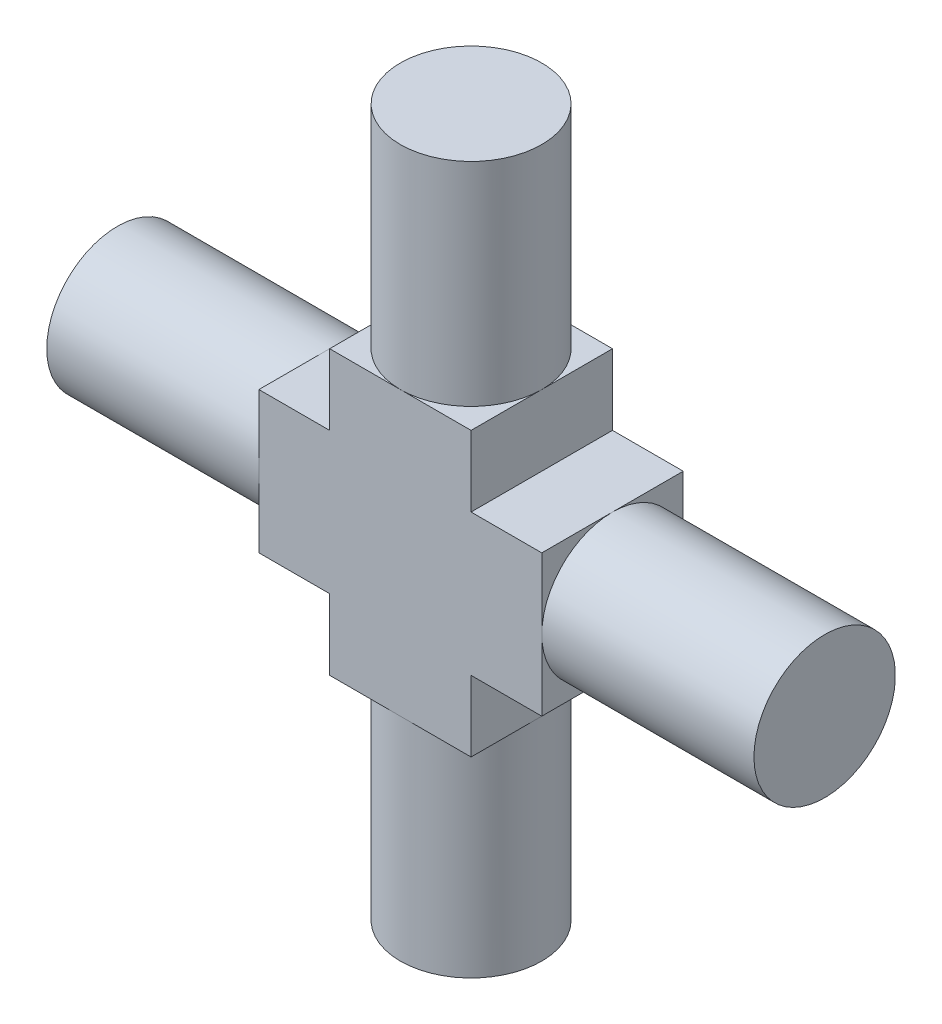
ISO-10303-21;
HEADER;
FILE_DESCRIPTION(('STEP AP214'),'2;1');
FILE_NAME('part.step','',(''),(''),'','','');
FILE_SCHEMA(('AUTOMOTIVE_DESIGN { 1 0 10303 214 1 1 1 1 }'));
ENDSEC;
DATA;
#1=APPLICATION_CONTEXT('core data for automotive mechanical design processes');
#2=APPLICATION_PROTOCOL_DEFINITION('international standard','automotive_design',2000,#1);
#3=PRODUCT_CONTEXT('',#1,'mechanical');
#4=PRODUCT('Part','Part','',(#3));
#5=PRODUCT_RELATED_PRODUCT_CATEGORY('part','',(#4));
#6=PRODUCT_DEFINITION_FORMATION('','',#4);
#7=PRODUCT_DEFINITION_CONTEXT('part definition',#1,'design');
#8=PRODUCT_DEFINITION('design','',#6,#7);
#9=PRODUCT_DEFINITION_SHAPE('','',#8);
#10=(LENGTH_UNIT() NAMED_UNIT(*) SI_UNIT(.MILLI.,.METRE.));
#11=(NAMED_UNIT(*) PLANE_ANGLE_UNIT() SI_UNIT($,.RADIAN.));
#12=(NAMED_UNIT(*) SI_UNIT($,.STERADIAN.) SOLID_ANGLE_UNIT());
#13=UNCERTAINTY_MEASURE_WITH_UNIT(LENGTH_MEASURE(1.E-05),#10,'distance_accuracy_value','');
#14=(GEOMETRIC_REPRESENTATION_CONTEXT(3) GLOBAL_UNCERTAINTY_ASSIGNED_CONTEXT((#13)) GLOBAL_UNIT_ASSIGNED_CONTEXT((#10,
#11,#12)) REPRESENTATION_CONTEXT('',''));
#15=CARTESIAN_POINT('',(0.,0.,0.));
#16=DIRECTION('',(0.,0.,1.));
#17=DIRECTION('',(1.,0.,0.));
#18=AXIS2_PLACEMENT_3D('',#15,#16,#17);
#19=CARTESIAN_POINT('',(-5.,2.5,5.));
#20=DIRECTION('',(1.,0.,0.));
#21=DIRECTION('',(0.,0.,-1.));
#22=AXIS2_PLACEMENT_3D('',#19,#20,#21);
#23=PLANE('',#22);
#24=CARTESIAN_POINT('',(-5.,0.,2.5));
#25=DIRECTION('',(-1.,0.,0.));
#26=DIRECTION('',(0.,0.,1.));
#27=AXIS2_PLACEMENT_3D('',#24,#25,#26);
#28=CIRCLE('',#27,2.5);
#29=CARTESIAN_POINT('',(-5.,0.,5.));
#30=VERTEX_POINT('',#29);
#31=CARTESIAN_POINT('',(-5.00000000000001,2.5,2.5));
#32=VERTEX_POINT('',#31);
#33=EDGE_CURVE('E57',#30,#32,#28,.T.);
#34=ORIENTED_EDGE('',*,*,#33,.F.);
#35=DIRECTION('',(0.,-1.,0.));
#36=VECTOR('',#35,1.);
#37=CARTESIAN_POINT('',(-5.,2.5,5.));
#38=LINE('',#37,#36);
#39=CARTESIAN_POINT('',(-5.,2.5,5.));
#40=VERTEX_POINT('',#39);
#41=EDGE_CURVE('E251',#40,#30,#38,.T.);
#42=ORIENTED_EDGE('',*,*,#41,.F.);
#43=DIRECTION('',(0.,0.,-1.));
#44=VECTOR('',#43,1.);
#45=CARTESIAN_POINT('',(-5.,2.5,5.));
#46=LINE('',#45,#44);
#47=EDGE_CURVE('E367',#40,#32,#46,.T.);
#48=ORIENTED_EDGE('',*,*,#47,.T.);
#49=EDGE_LOOP('',(#34,#42,#48));
#50=FACE_BOUND('',#49,.T.);
#51=ADVANCED_FACE('F45',(#50),#23,.F.);
#52=CARTESIAN_POINT('',(-5.,0.,0.));
#53=VERTEX_POINT('',#52);
#54=EDGE_CURVE('E11',#32,#53,#28,.T.);
#55=ORIENTED_EDGE('',*,*,#54,.F.);
#56=CARTESIAN_POINT('',(-5.,2.5,0.));
#57=VERTEX_POINT('',#56);
#58=EDGE_CURVE('E366',#32,#57,#46,.T.);
#59=ORIENTED_EDGE('',*,*,#58,.T.);
#60=DIRECTION('',(0.,-1.,0.));
#61=VECTOR('',#60,1.);
#62=CARTESIAN_POINT('',(-5.,2.5,0.));
#63=LINE('',#62,#61);
#64=EDGE_CURVE('E287',#57,#53,#63,.T.);
#65=ORIENTED_EDGE('',*,*,#64,.T.);
#66=EDGE_LOOP('',(#55,#59,#65));
#67=FACE_BOUND('',#66,.T.);
#68=ADVANCED_FACE('F378',(#67),#23,.F.);
#69=CARTESIAN_POINT('',(-4.99999999999999,-2.5,2.5));
#70=VERTEX_POINT('',#69);
#71=EDGE_CURVE('E55',#53,#70,#28,.T.);
#72=ORIENTED_EDGE('',*,*,#71,.F.);
#73=CARTESIAN_POINT('',(-5.,-2.5,0.));
#74=VERTEX_POINT('',#73);
#75=EDGE_CURVE('E286',#53,#74,#63,.T.);
#76=ORIENTED_EDGE('',*,*,#75,.T.);
#77=DIRECTION('',(0.,0.,-1.));
#78=VECTOR('',#77,1.);
#79=CARTESIAN_POINT('',(-5.,-2.5,5.));
#80=LINE('',#79,#78);
#81=EDGE_CURVE('E362',#70,#74,#80,.T.);
#82=ORIENTED_EDGE('',*,*,#81,.F.);
#83=EDGE_LOOP('',(#72,#76,#82));
#84=FACE_BOUND('',#83,.T.);
#85=ADVANCED_FACE('F430',(#84),#23,.F.);
#86=CARTESIAN_POINT('',(-2.5,-5.,5.));
#87=DIRECTION('',(0.,1.,0.));
#88=DIRECTION('',(-1.,0.,0.));
#89=AXIS2_PLACEMENT_3D('',#86,#87,#88);
#90=PLANE('',#89);
#91=CARTESIAN_POINT('',(0.,-5.,2.5));
#92=DIRECTION('',(0.,-1.,0.));
#93=DIRECTION('',(0.,0.,1.));
#94=AXIS2_PLACEMENT_3D('',#91,#92,#93);
#95=CIRCLE('',#94,2.5);
#96=CARTESIAN_POINT('',(0.,-5.,5.));
#97=VERTEX_POINT('',#96);
#98=CARTESIAN_POINT('',(-2.5,-5.,2.5));
#99=VERTEX_POINT('',#98);
#100=EDGE_CURVE('E400',#97,#99,#95,.T.);
#101=ORIENTED_EDGE('',*,*,#100,.F.);
#102=DIRECTION('',(1.,0.,0.));
#103=VECTOR('',#102,1.);
#104=CARTESIAN_POINT('',(-2.5,-5.,5.));
#105=LINE('',#104,#103);
#106=CARTESIAN_POINT('',(-2.5,-5.,5.));
#107=VERTEX_POINT('',#106);
#108=EDGE_CURVE('E261',#107,#97,#105,.T.);
#109=ORIENTED_EDGE('',*,*,#108,.F.);
#110=DIRECTION('',(0.,0.,-1.));
#111=VECTOR('',#110,1.);
#112=CARTESIAN_POINT('',(-2.5,-5.,5.));
#113=LINE('',#112,#111);
#114=EDGE_CURVE('E354',#107,#99,#113,.T.);
#115=ORIENTED_EDGE('',*,*,#114,.T.);
#116=EDGE_LOOP('',(#101,#109,#115));
#117=FACE_BOUND('',#116,.T.);
#118=ADVANCED_FACE('F441',(#117),#90,.F.);
#119=CARTESIAN_POINT('',(0.,-5.,0.));
#120=VERTEX_POINT('',#119);
#121=EDGE_CURVE('E404',#99,#120,#95,.T.);
#122=ORIENTED_EDGE('',*,*,#121,.F.);
#123=CARTESIAN_POINT('',(-2.5,-5.,0.));
#124=VERTEX_POINT('',#123);
#125=EDGE_CURVE('E353',#99,#124,#113,.T.);
#126=ORIENTED_EDGE('',*,*,#125,.T.);
#127=DIRECTION('',(1.,0.,0.));
#128=VECTOR('',#127,1.);
#129=CARTESIAN_POINT('',(-2.5,-5.,0.));
#130=LINE('',#129,#128);
#131=EDGE_CURVE('E298',#124,#120,#130,.T.);
#132=ORIENTED_EDGE('',*,*,#131,.T.);
#133=EDGE_LOOP('',(#122,#126,#132));
#134=FACE_BOUND('',#133,.T.);
#135=ADVANCED_FACE('F445',(#134),#90,.F.);
#136=CARTESIAN_POINT('',(2.5,-5.,2.5));
#137=VERTEX_POINT('',#136);
#138=EDGE_CURVE('E455',#120,#137,#95,.T.);
#139=ORIENTED_EDGE('',*,*,#138,.F.);
#140=CARTESIAN_POINT('',(2.5,-5.,0.));
#141=VERTEX_POINT('',#140);
#142=EDGE_CURVE('E297',#120,#141,#130,.T.);
#143=ORIENTED_EDGE('',*,*,#142,.T.);
#144=DIRECTION('',(0.,0.,-1.));
#145=VECTOR('',#144,1.);
#146=CARTESIAN_POINT('',(2.5,-5.,5.));
#147=LINE('',#146,#145);
#148=EDGE_CURVE('E348',#137,#141,#147,.T.);
#149=ORIENTED_EDGE('',*,*,#148,.F.);
#150=EDGE_LOOP('',(#139,#143,#149));
#151=FACE_BOUND('',#150,.T.);
#152=ADVANCED_FACE('F486',(#151),#90,.F.);
#153=CARTESIAN_POINT('',(5.,-2.5,5.));
#154=DIRECTION('',(-1.,0.,0.));
#155=DIRECTION('',(0.,-1.,0.));
#156=AXIS2_PLACEMENT_3D('',#153,#154,#155);
#157=PLANE('',#156);
#158=CARTESIAN_POINT('',(5.,0.,2.5));
#159=DIRECTION('',(1.,0.,0.));
#160=DIRECTION('',(0.,0.,1.));
#161=AXIS2_PLACEMENT_3D('',#158,#159,#160);
#162=CIRCLE('',#161,2.5);
#163=CARTESIAN_POINT('',(5.,0.,5.));
#164=VERTEX_POINT('',#163);
#165=CARTESIAN_POINT('',(5.00000000000003,-2.5,2.5));
#166=VERTEX_POINT('',#165);
#167=EDGE_CURVE('E211',#164,#166,#162,.T.);
#168=ORIENTED_EDGE('',*,*,#167,.F.);
#169=DIRECTION('',(0.,1.,0.));
#170=VECTOR('',#169,1.);
#171=CARTESIAN_POINT('',(5.,-2.5,5.));
#172=LINE('',#171,#170);
#173=CARTESIAN_POINT('',(5.,-2.5,5.));
#174=VERTEX_POINT('',#173);
#175=EDGE_CURVE('E186',#174,#164,#172,.T.);
#176=ORIENTED_EDGE('',*,*,#175,.F.);
#177=DIRECTION('',(0.,0.,-1.));
#178=VECTOR('',#177,1.);
#179=CARTESIAN_POINT('',(5.,-2.5,5.));
#180=LINE('',#179,#178);
#181=EDGE_CURVE('E213',#174,#166,#180,.T.);
#182=ORIENTED_EDGE('',*,*,#181,.T.);
#183=EDGE_LOOP('',(#168,#176,#182));
#184=FACE_BOUND('',#183,.T.);
#185=ADVANCED_FACE('F212',(#184),#157,.F.);
#186=CARTESIAN_POINT('',(5.,0.,0.));
#187=VERTEX_POINT('',#186);
#188=EDGE_CURVE('E219',#166,#187,#162,.T.);
#189=ORIENTED_EDGE('',*,*,#188,.F.);
#190=CARTESIAN_POINT('',(5.,-2.5,0.));
#191=VERTEX_POINT('',#190);
#192=EDGE_CURVE('E341',#166,#191,#180,.T.);
#193=ORIENTED_EDGE('',*,*,#192,.T.);
#194=DIRECTION('',(0.,1.,0.));
#195=VECTOR('',#194,1.);
#196=CARTESIAN_POINT('',(5.,-2.5,0.));
#197=LINE('',#196,#195);
#198=EDGE_CURVE('E310',#191,#187,#197,.T.);
#199=ORIENTED_EDGE('',*,*,#198,.T.);
#200=EDGE_LOOP('',(#189,#193,#199));
#201=FACE_BOUND('',#200,.T.);
#202=ADVANCED_FACE('F464',(#201),#157,.F.);
#203=CARTESIAN_POINT('',(4.99999999999998,2.5,2.5));
#204=VERTEX_POINT('',#203);
#205=EDGE_CURVE('E222',#187,#204,#162,.T.);
#206=ORIENTED_EDGE('',*,*,#205,.F.);
#207=CARTESIAN_POINT('',(5.,2.5,0.));
#208=VERTEX_POINT('',#207);
#209=EDGE_CURVE('E309',#187,#208,#197,.T.);
#210=ORIENTED_EDGE('',*,*,#209,.T.);
#211=DIRECTION('',(0.,0.,-1.));
#212=VECTOR('',#211,1.);
#213=CARTESIAN_POINT('',(5.,2.5,5.));
#214=LINE('',#213,#212);
#215=EDGE_CURVE('E338',#204,#208,#214,.T.);
#216=ORIENTED_EDGE('',*,*,#215,.F.);
#217=EDGE_LOOP('',(#206,#210,#216));
#218=FACE_BOUND('',#217,.T.);
#219=ADVANCED_FACE('F566',(#218),#157,.F.);
#220=CARTESIAN_POINT('',(2.5,5.,5.));
#221=DIRECTION('',(0.,-1.,0.));
#222=DIRECTION('',(0.,0.,-1.));
#223=AXIS2_PLACEMENT_3D('',#220,#221,#222);
#224=PLANE('',#223);
#225=CARTESIAN_POINT('',(0.,5.,2.5));
#226=DIRECTION('',(0.,1.,0.));
#227=DIRECTION('',(0.,0.,1.));
#228=AXIS2_PLACEMENT_3D('',#225,#226,#227);
#229=CIRCLE('',#228,2.5);
#230=CARTESIAN_POINT('',(0.,5.,5.));
#231=VERTEX_POINT('',#230);
#232=CARTESIAN_POINT('',(2.5,5.,2.5));
#233=VERTEX_POINT('',#232);
#234=EDGE_CURVE('E230',#231,#233,#229,.T.);
#235=ORIENTED_EDGE('',*,*,#234,.F.);
#236=DIRECTION('',(-1.,0.,0.));
#237=VECTOR('',#236,1.);
#238=CARTESIAN_POINT('',(2.5,5.,5.));
#239=LINE('',#238,#237);
#240=CARTESIAN_POINT('',(2.5,5.,5.));
#241=VERTEX_POINT('',#240);
#242=EDGE_CURVE('E275',#241,#231,#239,.T.);
#243=ORIENTED_EDGE('',*,*,#242,.F.);
#244=DIRECTION('',(0.,0.,-1.));
#245=VECTOR('',#244,1.);
#246=CARTESIAN_POINT('',(2.5,5.,5.));
#247=LINE('',#246,#245);
#248=EDGE_CURVE('E330',#241,#233,#247,.T.);
#249=ORIENTED_EDGE('',*,*,#248,.T.);
#250=EDGE_LOOP('',(#235,#243,#249));
#251=FACE_BOUND('',#250,.T.);
#252=ADVANCED_FACE('F611',(#251),#224,.F.);
#253=CARTESIAN_POINT('',(0.,5.,0.));
#254=VERTEX_POINT('',#253);
#255=EDGE_CURVE('E224',#233,#254,#229,.T.);
#256=ORIENTED_EDGE('',*,*,#255,.F.);
#257=CARTESIAN_POINT('',(2.5,5.,0.));
#258=VERTEX_POINT('',#257);
#259=EDGE_CURVE('E329',#233,#258,#247,.T.);
#260=ORIENTED_EDGE('',*,*,#259,.T.);
#261=DIRECTION('',(-1.,0.,0.));
#262=VECTOR('',#261,1.);
#263=CARTESIAN_POINT('',(2.5,5.,0.));
#264=LINE('',#263,#262);
#265=EDGE_CURVE('E247',#258,#254,#264,.T.);
#266=ORIENTED_EDGE('',*,*,#265,.T.);
#267=EDGE_LOOP('',(#256,#260,#266));
#268=FACE_BOUND('',#267,.T.);
#269=ADVANCED_FACE('F602',(#268),#224,.F.);
#270=CARTESIAN_POINT('',(-2.5,5.,2.5));
#271=VERTEX_POINT('',#270);
#272=EDGE_CURVE('E228',#254,#271,#229,.T.);
#273=ORIENTED_EDGE('',*,*,#272,.F.);
#274=CARTESIAN_POINT('',(-2.5,5.,0.));
#275=VERTEX_POINT('',#274);
#276=EDGE_CURVE('E321',#254,#275,#264,.T.);
#277=ORIENTED_EDGE('',*,*,#276,.T.);
#278=DIRECTION('',(0.,0.,-1.));
#279=VECTOR('',#278,1.);
#280=CARTESIAN_POINT('',(-2.5,5.,5.));
#281=LINE('',#280,#279);
#282=EDGE_CURVE('E278',#271,#275,#281,.T.);
#283=ORIENTED_EDGE('',*,*,#282,.F.);
#284=EDGE_LOOP('',(#273,#277,#283));
#285=FACE_BOUND('',#284,.T.);
#286=ADVANCED_FACE('F597',(#285),#224,.F.);
#287=CARTESIAN_POINT('',(-2.5,5.,5.));
#288=DIRECTION('',(1.,0.,0.));
#289=DIRECTION('',(0.,1.,0.));
#290=AXIS2_PLACEMENT_3D('',#287,#288,#289);
#291=PLANE('',#290);
#292=DIRECTION('',(0.,-1.,0.));
#293=VECTOR('',#292,1.);
#294=CARTESIAN_POINT('',(-2.5,5.,0.));
#295=LINE('',#294,#293);
#296=CARTESIAN_POINT('',(-2.5,2.5,0.));
#297=VERTEX_POINT('',#296);
#298=EDGE_CURVE('E237',#275,#297,#295,.T.);
#299=ORIENTED_EDGE('',*,*,#298,.T.);
#300=DIRECTION('',(0.,0.,-1.));
#301=VECTOR('',#300,1.);
#302=CARTESIAN_POINT('',(-2.5,2.5,5.));
#303=LINE('',#302,#301);
#304=CARTESIAN_POINT('',(-2.5,2.5,5.));
#305=VERTEX_POINT('',#304);
#306=EDGE_CURVE('E49',#305,#297,#303,.T.);
#307=ORIENTED_EDGE('',*,*,#306,.F.);
#308=DIRECTION('',(0.,-1.,0.));
#309=VECTOR('',#308,1.);
#310=CARTESIAN_POINT('',(-2.5,5.,5.));
#311=LINE('',#310,#309);
#312=CARTESIAN_POINT('',(-2.5,5.,5.));
#313=VERTEX_POINT('',#312);
#314=EDGE_CURVE('E243',#313,#305,#311,.T.);
#315=ORIENTED_EDGE('',*,*,#314,.F.);
#316=EDGE_CURVE('E325',#313,#271,#281,.T.);
#317=ORIENTED_EDGE('',*,*,#316,.T.);
#318=ORIENTED_EDGE('',*,*,#282,.T.);
#319=EDGE_LOOP('',(#299,#307,#315,#317,#318));
#320=FACE_BOUND('',#319,.T.);
#321=ADVANCED_FACE('F47',(#320),#291,.F.);
#322=CARTESIAN_POINT('',(-2.5,2.5,5.));
#323=DIRECTION('',(0.,-1.,0.));
#324=DIRECTION('',(1.,0.,0.));
#325=AXIS2_PLACEMENT_3D('',#322,#323,#324);
#326=PLANE('',#325);
#327=DIRECTION('',(-1.,0.,0.));
#328=VECTOR('',#327,1.);
#329=CARTESIAN_POINT('',(-2.5,2.5,0.));
#330=LINE('',#329,#328);
#331=EDGE_CURVE('E282',#297,#57,#330,.T.);
#332=ORIENTED_EDGE('',*,*,#331,.T.);
#333=ORIENTED_EDGE('',*,*,#58,.F.);
#334=ORIENTED_EDGE('',*,*,#47,.F.);
#335=DIRECTION('',(-1.,0.,0.));
#336=VECTOR('',#335,1.);
#337=CARTESIAN_POINT('',(-2.5,2.5,5.));
#338=LINE('',#337,#336);
#339=EDGE_CURVE('E246',#305,#40,#338,.T.);
#340=ORIENTED_EDGE('',*,*,#339,.F.);
#341=ORIENTED_EDGE('',*,*,#306,.T.);
#342=EDGE_LOOP('',(#332,#333,#334,#340,#341));
#343=FACE_BOUND('',#342,.T.);
#344=ADVANCED_FACE('F381',(#343),#326,.F.);
#345=EDGE_CURVE('E70',#70,#30,#28,.T.);
#346=ORIENTED_EDGE('',*,*,#345,.F.);
#347=CARTESIAN_POINT('',(-5.,-2.5,5.));
#348=VERTEX_POINT('',#347);
#349=EDGE_CURVE('E363',#348,#70,#80,.T.);
#350=ORIENTED_EDGE('',*,*,#349,.F.);
#351=EDGE_CURVE('E250',#30,#348,#38,.T.);
#352=ORIENTED_EDGE('',*,*,#351,.F.);
#353=EDGE_LOOP('',(#346,#350,#352));
#354=FACE_BOUND('',#353,.T.);
#355=ADVANCED_FACE('F426',(#354),#23,.F.);
#356=CARTESIAN_POINT('',(-5.,-2.5,5.));
#357=DIRECTION('',(0.,1.,0.));
#358=DIRECTION('',(-1.,0.,0.));
#359=AXIS2_PLACEMENT_3D('',#356,#357,#358);
#360=PLANE('',#359);
#361=DIRECTION('',(1.,0.,0.));
#362=VECTOR('',#361,1.);
#363=CARTESIAN_POINT('',(-5.,-2.5,0.));
#364=LINE('',#363,#362);
#365=CARTESIAN_POINT('',(-2.5,-2.5,0.));
#366=VERTEX_POINT('',#365);
#367=EDGE_CURVE('E290',#74,#366,#364,.T.);
#368=ORIENTED_EDGE('',*,*,#367,.T.);
#369=DIRECTION('',(0.,0.,-1.));
#370=VECTOR('',#369,1.);
#371=CARTESIAN_POINT('',(-2.5,-2.5,5.));
#372=LINE('',#371,#370);
#373=CARTESIAN_POINT('',(-2.5,-2.5,5.));
#374=VERTEX_POINT('',#373);
#375=EDGE_CURVE('E358',#374,#366,#372,.T.);
#376=ORIENTED_EDGE('',*,*,#375,.F.);
#377=DIRECTION('',(1.,0.,0.));
#378=VECTOR('',#377,1.);
#379=CARTESIAN_POINT('',(-5.,-2.5,5.));
#380=LINE('',#379,#378);
#381=EDGE_CURVE('E254',#348,#374,#380,.T.);
#382=ORIENTED_EDGE('',*,*,#381,.F.);
#383=ORIENTED_EDGE('',*,*,#349,.T.);
#384=ORIENTED_EDGE('',*,*,#81,.T.);
#385=EDGE_LOOP('',(#368,#376,#382,#383,#384));
#386=FACE_BOUND('',#385,.T.);
#387=ADVANCED_FACE('F433',(#386),#360,.F.);
#388=CARTESIAN_POINT('',(-2.5,-2.5,5.));
#389=DIRECTION('',(1.,0.,0.));
#390=DIRECTION('',(0.,1.,0.));
#391=AXIS2_PLACEMENT_3D('',#388,#389,#390);
#392=PLANE('',#391);
#393=DIRECTION('',(0.,-1.,0.));
#394=VECTOR('',#393,1.);
#395=CARTESIAN_POINT('',(-2.5,-2.5,0.));
#396=LINE('',#395,#394);
#397=EDGE_CURVE('E293',#366,#124,#396,.T.);
#398=ORIENTED_EDGE('',*,*,#397,.T.);
#399=ORIENTED_EDGE('',*,*,#125,.F.);
#400=ORIENTED_EDGE('',*,*,#114,.F.);
#401=DIRECTION('',(0.,-1.,0.));
#402=VECTOR('',#401,1.);
#403=CARTESIAN_POINT('',(-2.5,-2.5,5.));
#404=LINE('',#403,#402);
#405=EDGE_CURVE('E257',#374,#107,#404,.T.);
#406=ORIENTED_EDGE('',*,*,#405,.F.);
#407=ORIENTED_EDGE('',*,*,#375,.T.);
#408=EDGE_LOOP('',(#398,#399,#400,#406,#407));
#409=FACE_BOUND('',#408,.T.);
#410=ADVANCED_FACE('F438',(#409),#392,.F.);
#411=EDGE_CURVE('E405',#137,#97,#95,.T.);
#412=ORIENTED_EDGE('',*,*,#411,.F.);
#413=CARTESIAN_POINT('',(2.5,-5.,5.));
#414=VERTEX_POINT('',#413);
#415=EDGE_CURVE('E349',#414,#137,#147,.T.);
#416=ORIENTED_EDGE('',*,*,#415,.F.);
#417=EDGE_CURVE('E260',#97,#414,#105,.T.);
#418=ORIENTED_EDGE('',*,*,#417,.F.);
#419=EDGE_LOOP('',(#412,#416,#418));
#420=FACE_BOUND('',#419,.T.);
#421=ADVANCED_FACE('F448',(#420),#90,.F.);
#422=CARTESIAN_POINT('',(2.5,-5.,5.));
#423=DIRECTION('',(-1.,0.,0.));
#424=DIRECTION('',(0.,0.,1.));
#425=AXIS2_PLACEMENT_3D('',#422,#423,#424);
#426=PLANE('',#425);
#427=DIRECTION('',(0.,1.,0.));
#428=VECTOR('',#427,1.);
#429=CARTESIAN_POINT('',(2.5,-5.,0.));
#430=LINE('',#429,#428);
#431=CARTESIAN_POINT('',(2.5,-2.5,0.));
#432=VERTEX_POINT('',#431);
#433=EDGE_CURVE('E302',#141,#432,#430,.T.);
#434=ORIENTED_EDGE('',*,*,#433,.T.);
#435=DIRECTION('',(0.,0.,-1.));
#436=VECTOR('',#435,1.);
#437=CARTESIAN_POINT('',(2.5,-2.5,5.));
#438=LINE('',#437,#436);
#439=CARTESIAN_POINT('',(2.5,-2.5,5.));
#440=VERTEX_POINT('',#439);
#441=EDGE_CURVE('E344',#440,#432,#438,.T.);
#442=ORIENTED_EDGE('',*,*,#441,.F.);
#443=DIRECTION('',(0.,1.,0.));
#444=VECTOR('',#443,1.);
#445=CARTESIAN_POINT('',(2.5,-5.,5.));
#446=LINE('',#445,#444);
#447=EDGE_CURVE('E264',#414,#440,#446,.T.);
#448=ORIENTED_EDGE('',*,*,#447,.F.);
#449=ORIENTED_EDGE('',*,*,#415,.T.);
#450=ORIENTED_EDGE('',*,*,#148,.T.);
#451=EDGE_LOOP('',(#434,#442,#448,#449,#450));
#452=FACE_BOUND('',#451,.T.);
#453=ADVANCED_FACE('F490',(#452),#426,.F.);
#454=CARTESIAN_POINT('',(2.5,-2.5,5.));
#455=DIRECTION('',(0.,1.,0.));
#456=DIRECTION('',(-1.,0.,0.));
#457=AXIS2_PLACEMENT_3D('',#454,#455,#456);
#458=PLANE('',#457);
#459=DIRECTION('',(1.,0.,0.));
#460=VECTOR('',#459,1.);
#461=CARTESIAN_POINT('',(2.5,-2.5,0.));
#462=LINE('',#461,#460);
#463=EDGE_CURVE('E305',#432,#191,#462,.T.);
#464=ORIENTED_EDGE('',*,*,#463,.T.);
#465=ORIENTED_EDGE('',*,*,#192,.F.);
#466=ORIENTED_EDGE('',*,*,#181,.F.);
#467=DIRECTION('',(1.,0.,0.));
#468=VECTOR('',#467,1.);
#469=CARTESIAN_POINT('',(2.5,-2.5,5.));
#470=LINE('',#469,#468);
#471=EDGE_CURVE('E193',#440,#174,#470,.T.);
#472=ORIENTED_EDGE('',*,*,#471,.F.);
#473=ORIENTED_EDGE('',*,*,#441,.T.);
#474=EDGE_LOOP('',(#464,#465,#466,#472,#473));
#475=FACE_BOUND('',#474,.T.);
#476=ADVANCED_FACE('F467',(#475),#458,.F.);
#477=EDGE_CURVE('E204',#204,#164,#162,.T.);
#478=ORIENTED_EDGE('',*,*,#477,.F.);
#479=CARTESIAN_POINT('',(5.,2.5,5.));
#480=VERTEX_POINT('',#479);
#481=EDGE_CURVE('E207',#480,#204,#214,.T.);
#482=ORIENTED_EDGE('',*,*,#481,.F.);
#483=EDGE_CURVE('E190',#164,#480,#172,.T.);
#484=ORIENTED_EDGE('',*,*,#483,.F.);
#485=EDGE_LOOP('',(#478,#482,#484));
#486=FACE_BOUND('',#485,.T.);
#487=ADVANCED_FACE('F202',(#486),#157,.F.);
#488=CARTESIAN_POINT('',(5.,2.5,5.));
#489=DIRECTION('',(0.,-1.,0.));
#490=DIRECTION('',(1.,0.,0.));
#491=AXIS2_PLACEMENT_3D('',#488,#489,#490);
#492=PLANE('',#491);
#493=DIRECTION('',(-1.,0.,0.));
#494=VECTOR('',#493,1.);
#495=CARTESIAN_POINT('',(5.,2.5,0.));
#496=LINE('',#495,#494);
#497=CARTESIAN_POINT('',(2.5,2.5,0.));
#498=VERTEX_POINT('',#497);
#499=EDGE_CURVE('E314',#208,#498,#496,.T.);
#500=ORIENTED_EDGE('',*,*,#499,.T.);
#501=DIRECTION('',(0.,0.,-1.));
#502=VECTOR('',#501,1.);
#503=CARTESIAN_POINT('',(2.5,2.5,5.));
#504=LINE('',#503,#502);
#505=CARTESIAN_POINT('',(2.5,2.5,5.));
#506=VERTEX_POINT('',#505);
#507=EDGE_CURVE('E334',#506,#498,#504,.T.);
#508=ORIENTED_EDGE('',*,*,#507,.F.);
#509=DIRECTION('',(-1.,0.,0.));
#510=VECTOR('',#509,1.);
#511=CARTESIAN_POINT('',(5.,2.5,5.));
#512=LINE('',#511,#510);
#513=EDGE_CURVE('E199',#480,#506,#512,.T.);
#514=ORIENTED_EDGE('',*,*,#513,.F.);
#515=ORIENTED_EDGE('',*,*,#481,.T.);
#516=ORIENTED_EDGE('',*,*,#215,.T.);
#517=EDGE_LOOP('',(#500,#508,#514,#515,#516));
#518=FACE_BOUND('',#517,.T.);
#519=ADVANCED_FACE('F564',(#518),#492,.F.);
#520=CARTESIAN_POINT('',(2.5,2.5,5.));
#521=DIRECTION('',(-1.,0.,0.));
#522=DIRECTION('',(0.,-1.,0.));
#523=AXIS2_PLACEMENT_3D('',#520,#521,#522);
#524=PLANE('',#523);
#525=DIRECTION('',(0.,1.,0.));
#526=VECTOR('',#525,1.);
#527=CARTESIAN_POINT('',(2.5,2.5,0.));
#528=LINE('',#527,#526);
#529=EDGE_CURVE('E317',#498,#258,#528,.T.);
#530=ORIENTED_EDGE('',*,*,#529,.T.);
#531=ORIENTED_EDGE('',*,*,#259,.F.);
#532=ORIENTED_EDGE('',*,*,#248,.F.);
#533=DIRECTION('',(0.,1.,0.));
#534=VECTOR('',#533,1.);
#535=CARTESIAN_POINT('',(2.5,2.5,5.));
#536=LINE('',#535,#534);
#537=EDGE_CURVE('E271',#506,#241,#536,.T.);
#538=ORIENTED_EDGE('',*,*,#537,.F.);
#539=ORIENTED_EDGE('',*,*,#507,.T.);
#540=EDGE_LOOP('',(#530,#531,#532,#538,#539));
#541=FACE_BOUND('',#540,.T.);
#542=ADVANCED_FACE('F573',(#541),#524,.F.);
#543=EDGE_CURVE('E242',#271,#231,#229,.T.);
#544=ORIENTED_EDGE('',*,*,#543,.F.);
#545=ORIENTED_EDGE('',*,*,#316,.F.);
#546=EDGE_CURVE('E274',#231,#313,#239,.T.);
#547=ORIENTED_EDGE('',*,*,#546,.F.);
#548=EDGE_LOOP('',(#544,#545,#547));
#549=FACE_BOUND('',#548,.T.);
#550=ADVANCED_FACE('F582',(#549),#224,.F.);
#551=CARTESIAN_POINT('',(0.,0.,5.));
#552=DIRECTION('',(0.,0.,-1.));
#553=DIRECTION('',(-1.,0.,0.));
#554=AXIS2_PLACEMENT_3D('',#551,#552,#553);
#555=PLANE('',#554);
#556=ORIENTED_EDGE('',*,*,#314,.T.);
#557=ORIENTED_EDGE('',*,*,#339,.T.);
#558=ORIENTED_EDGE('',*,*,#41,.T.);
#559=ORIENTED_EDGE('',*,*,#351,.T.);
#560=ORIENTED_EDGE('',*,*,#381,.T.);
#561=ORIENTED_EDGE('',*,*,#405,.T.);
#562=ORIENTED_EDGE('',*,*,#108,.T.);
#563=ORIENTED_EDGE('',*,*,#417,.T.);
#564=ORIENTED_EDGE('',*,*,#447,.T.);
#565=ORIENTED_EDGE('',*,*,#471,.T.);
#566=ORIENTED_EDGE('',*,*,#175,.T.);
#567=ORIENTED_EDGE('',*,*,#483,.T.);
#568=ORIENTED_EDGE('',*,*,#513,.T.);
#569=ORIENTED_EDGE('',*,*,#537,.T.);
#570=ORIENTED_EDGE('',*,*,#242,.T.);
#571=ORIENTED_EDGE('',*,*,#546,.T.);
#572=EDGE_LOOP('',(#556,#557,#558,#559,#560,#561,#562,#563,#564,#565,#566,#567,#568,#569,#570,#571));
#573=FACE_BOUND('',#572,.T.);
#574=ADVANCED_FACE('F189',(#573),#555,.F.);
#575=CARTESIAN_POINT('',(0.,0.,0.));
#576=DIRECTION('',(0.,0.,-1.));
#577=DIRECTION('',(-1.,0.,0.));
#578=AXIS2_PLACEMENT_3D('',#575,#576,#577);
#579=PLANE('',#578);
#580=ORIENTED_EDGE('',*,*,#298,.F.);
#581=ORIENTED_EDGE('',*,*,#276,.F.);
#582=ORIENTED_EDGE('',*,*,#265,.F.);
#583=ORIENTED_EDGE('',*,*,#529,.F.);
#584=ORIENTED_EDGE('',*,*,#499,.F.);
#585=ORIENTED_EDGE('',*,*,#209,.F.);
#586=ORIENTED_EDGE('',*,*,#198,.F.);
#587=ORIENTED_EDGE('',*,*,#463,.F.);
#588=ORIENTED_EDGE('',*,*,#433,.F.);
#589=ORIENTED_EDGE('',*,*,#142,.F.);
#590=ORIENTED_EDGE('',*,*,#131,.F.);
#591=ORIENTED_EDGE('',*,*,#397,.F.);
#592=ORIENTED_EDGE('',*,*,#367,.F.);
#593=ORIENTED_EDGE('',*,*,#75,.F.);
#594=ORIENTED_EDGE('',*,*,#64,.F.);
#595=ORIENTED_EDGE('',*,*,#331,.F.);
#596=EDGE_LOOP('',(#580,#581,#582,#583,#584,#585,#586,#587,#588,#589,#590,#591,#592,#593,#594,#595));
#597=FACE_BOUND('',#596,.T.);
#598=ADVANCED_FACE('F386',(#597),#579,.T.);
#599=CARTESIAN_POINT('',(0.,12.5,2.5));
#600=DIRECTION('',(0.,-1.,0.));
#601=DIRECTION('',(0.,0.,-1.));
#602=AXIS2_PLACEMENT_3D('',#599,#600,#601);
#603=CYLINDRICAL_SURFACE('',#602,2.5);
#604=CARTESIAN_POINT('',(0.,12.5,2.5));
#605=DIRECTION('',(0.,1.,0.));
#606=DIRECTION('',(0.,0.,1.));
#607=AXIS2_PLACEMENT_3D('',#604,#605,#606);
#608=CIRCLE('',#607,2.5);
#609=CARTESIAN_POINT('',(0.,12.5,5.));
#610=VERTEX_POINT('',#609);
#611=EDGE_CURVE('E234',#610,#610,#608,.T.);
#612=ORIENTED_EDGE('',*,*,#611,.F.);
#613=EDGE_LOOP('',(#612));
#614=FACE_BOUND('',#613,.T.);
#615=ORIENTED_EDGE('',*,*,#234,.T.);
#616=ORIENTED_EDGE('',*,*,#255,.T.);
#617=ORIENTED_EDGE('',*,*,#272,.T.);
#618=ORIENTED_EDGE('',*,*,#543,.T.);
#619=EDGE_LOOP('',(#615,#616,#617,#618));
#620=FACE_BOUND('',#619,.T.);
#621=ADVANCED_FACE('F421',(#614,#620),#603,.T.);
#622=CARTESIAN_POINT('',(0.,12.5,2.5));
#623=DIRECTION('',(0.,1.,0.));
#624=DIRECTION('',(0.,0.,1.));
#625=AXIS2_PLACEMENT_3D('',#622,#623,#624);
#626=PLANE('',#625);
#627=ORIENTED_EDGE('',*,*,#611,.T.);
#628=EDGE_LOOP('',(#627));
#629=FACE_BOUND('',#628,.T.);
#630=ADVANCED_FACE('F412',(#629),#626,.T.);
#631=CARTESIAN_POINT('',(12.5,1.30930550206618E-13,2.5));
#632=DIRECTION('',(-1.,0.,0.));
#633=DIRECTION('',(0.,-1.,0.));
#634=AXIS2_PLACEMENT_3D('',#631,#632,#633);
#635=CYLINDRICAL_SURFACE('',#634,2.5);
#636=CARTESIAN_POINT('',(12.5,1.30930550206618E-13,2.5));
#637=DIRECTION('',(1.,0.,0.));
#638=DIRECTION('',(0.,0.,1.));
#639=AXIS2_PLACEMENT_3D('',#636,#637,#638);
#640=CIRCLE('',#639,2.5);
#641=CARTESIAN_POINT('',(12.5,1.30930550206618E-13,5.));
#642=VERTEX_POINT('',#641);
#643=EDGE_CURVE('E217',#642,#642,#640,.T.);
#644=ORIENTED_EDGE('',*,*,#643,.F.);
#645=EDGE_LOOP('',(#644));
#646=FACE_BOUND('',#645,.T.);
#647=ORIENTED_EDGE('',*,*,#167,.T.);
#648=ORIENTED_EDGE('',*,*,#188,.T.);
#649=ORIENTED_EDGE('',*,*,#205,.T.);
#650=ORIENTED_EDGE('',*,*,#477,.T.);
#651=EDGE_LOOP('',(#647,#648,#649,#650));
#652=FACE_BOUND('',#651,.T.);
#653=ADVANCED_FACE('F221',(#646,#652),#635,.T.);
#654=CARTESIAN_POINT('',(12.5,1.30930550206618E-13,2.5));
#655=DIRECTION('',(1.,0.,0.));
#656=DIRECTION('',(0.,0.,1.));
#657=AXIS2_PLACEMENT_3D('',#654,#655,#656);
#658=PLANE('',#657);
#659=ORIENTED_EDGE('',*,*,#643,.T.);
#660=EDGE_LOOP('',(#659));
#661=FACE_BOUND('',#660,.T.);
#662=ADVANCED_FACE('F409',(#661),#658,.T.);
#663=CARTESIAN_POINT('',(0.,-12.5,2.5));
#664=DIRECTION('',(0.,1.,0.));
#665=DIRECTION('',(0.,0.,1.));
#666=AXIS2_PLACEMENT_3D('',#663,#664,#665);
#667=CYLINDRICAL_SURFACE('',#666,2.5);
#668=CARTESIAN_POINT('',(0.,-12.5,2.5));
#669=DIRECTION('',(0.,-1.,0.));
#670=DIRECTION('',(0.,0.,1.));
#671=AXIS2_PLACEMENT_3D('',#668,#669,#670);
#672=CIRCLE('',#671,2.5);
#673=CARTESIAN_POINT('',(0.,-12.5,5.));
#674=VERTEX_POINT('',#673);
#675=EDGE_CURVE('E397',#674,#674,#672,.T.);
#676=ORIENTED_EDGE('',*,*,#675,.F.);
#677=EDGE_LOOP('',(#676));
#678=FACE_BOUND('',#677,.T.);
#679=ORIENTED_EDGE('',*,*,#100,.T.);
#680=ORIENTED_EDGE('',*,*,#121,.T.);
#681=ORIENTED_EDGE('',*,*,#138,.T.);
#682=ORIENTED_EDGE('',*,*,#411,.T.);
#683=EDGE_LOOP('',(#679,#680,#681,#682));
#684=FACE_BOUND('',#683,.T.);
#685=ADVANCED_FACE('F418',(#678,#684),#667,.T.);
#686=CARTESIAN_POINT('',(0.,-12.5,2.5));
#687=DIRECTION('',(0.,-1.,0.));
#688=DIRECTION('',(0.,0.,1.));
#689=AXIS2_PLACEMENT_3D('',#686,#687,#688);
#690=PLANE('',#689);
#691=ORIENTED_EDGE('',*,*,#675,.T.);
#692=EDGE_LOOP('',(#691));
#693=FACE_BOUND('',#692,.T.);
#694=ADVANCED_FACE('F501',(#693),#690,.T.);
#695=CARTESIAN_POINT('',(-12.5,0.,2.5));
#696=DIRECTION('',(1.,0.,0.));
#697=DIRECTION('',(0.,1.,0.));
#698=AXIS2_PLACEMENT_3D('',#695,#696,#697);
#699=CYLINDRICAL_SURFACE('',#698,2.5);
#700=CARTESIAN_POINT('',(-12.5,0.,2.5));
#701=DIRECTION('',(-1.,0.,0.));
#702=DIRECTION('',(0.,0.,1.));
#703=AXIS2_PLACEMENT_3D('',#700,#701,#702);
#704=CIRCLE('',#703,2.5);
#705=CARTESIAN_POINT('',(-12.5,0.,5.));
#706=VERTEX_POINT('',#705);
#707=EDGE_CURVE('E241',#706,#706,#704,.T.);
#708=ORIENTED_EDGE('',*,*,#707,.F.);
#709=EDGE_LOOP('',(#708));
#710=FACE_BOUND('',#709,.T.);
#711=ORIENTED_EDGE('',*,*,#33,.T.);
#712=ORIENTED_EDGE('',*,*,#54,.T.);
#713=ORIENTED_EDGE('',*,*,#71,.T.);
#714=ORIENTED_EDGE('',*,*,#345,.T.);
#715=EDGE_LOOP('',(#711,#712,#713,#714));
#716=FACE_BOUND('',#715,.T.);
#717=ADVANCED_FACE('F498',(#710,#716),#699,.T.);
#718=CARTESIAN_POINT('',(-12.5,0.,2.5));
#719=DIRECTION('',(-1.,0.,0.));
#720=DIRECTION('',(0.,0.,1.));
#721=AXIS2_PLACEMENT_3D('',#718,#719,#720);
#722=PLANE('',#721);
#723=ORIENTED_EDGE('',*,*,#707,.T.);
#724=EDGE_LOOP('',(#723));
#725=FACE_BOUND('',#724,.T.);
#726=ADVANCED_FACE('F500',(#725),#722,.T.);
#727=CLOSED_SHELL('',(#51,#68,#85,#118,#135,#152,#185,#202,#219,#252,#269,#286,#321,#344,#355,
#387,#410,#421,#453,#476,#487,#519,#542,#550,#574,#598,#621,#630,#653,#662,#685,#694,#717,#726));
#728=MANIFOLD_SOLID_BREP('B2',#727);
#729=ADVANCED_BREP_SHAPE_REPRESENTATION('',(#18,#728),#14);
#730=SHAPE_DEFINITION_REPRESENTATION(#9,#729);
ENDSEC;
END-ISO-10303-21;
